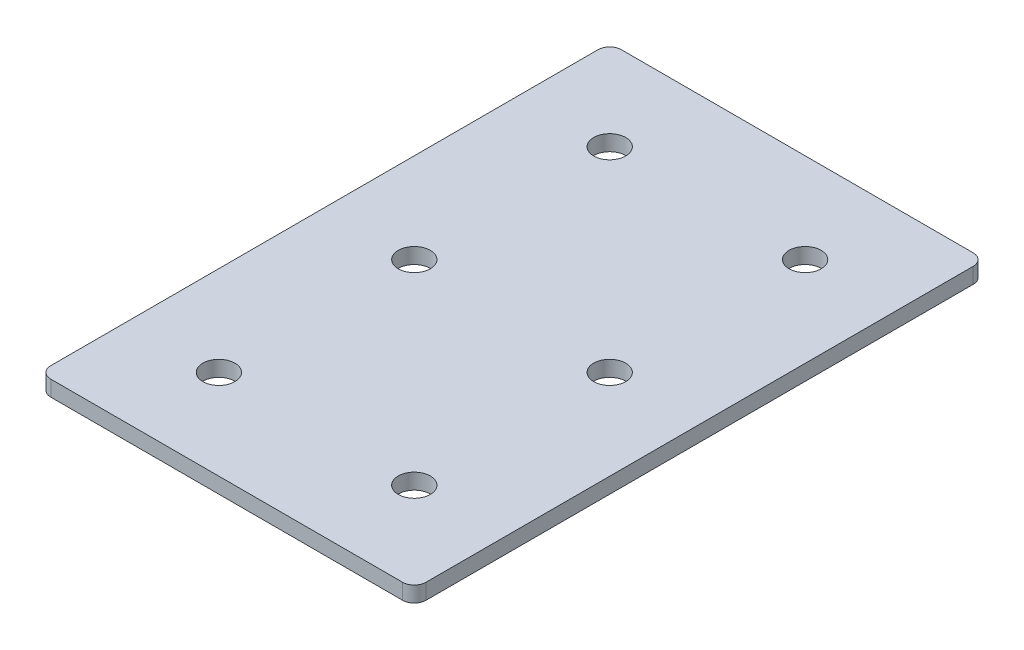
ISO-10303-21;
HEADER;
FILE_DESCRIPTION(('STEP AP214'),'2;1');
FILE_NAME('part.step','',(''),(''),'','','');
FILE_SCHEMA(('AUTOMOTIVE_DESIGN { 1 0 10303 214 1 1 1 1 }'));
ENDSEC;
DATA;
#1=APPLICATION_CONTEXT('core data for automotive mechanical design processes');
#2=APPLICATION_PROTOCOL_DEFINITION('international standard','automotive_design',2000,#1);
#3=PRODUCT_CONTEXT('',#1,'mechanical');
#4=PRODUCT('Part','Part','',(#3));
#5=PRODUCT_RELATED_PRODUCT_CATEGORY('part','',(#4));
#6=PRODUCT_DEFINITION_FORMATION('','',#4);
#7=PRODUCT_DEFINITION_CONTEXT('part definition',#1,'design');
#8=PRODUCT_DEFINITION('design','',#6,#7);
#9=PRODUCT_DEFINITION_SHAPE('','',#8);
#10=(LENGTH_UNIT() NAMED_UNIT(*) SI_UNIT(.MILLI.,.METRE.));
#11=(NAMED_UNIT(*) PLANE_ANGLE_UNIT() SI_UNIT($,.RADIAN.));
#12=(NAMED_UNIT(*) SI_UNIT($,.STERADIAN.) SOLID_ANGLE_UNIT());
#13=UNCERTAINTY_MEASURE_WITH_UNIT(LENGTH_MEASURE(1.E-05),#10,'distance_accuracy_value','');
#14=(GEOMETRIC_REPRESENTATION_CONTEXT(3) GLOBAL_UNCERTAINTY_ASSIGNED_CONTEXT((#13)) GLOBAL_UNIT_ASSIGNED_CONTEXT((#10,
#11,#12)) REPRESENTATION_CONTEXT('',''));
#15=CARTESIAN_POINT('',(0.,0.,0.));
#16=DIRECTION('',(0.,0.,1.));
#17=DIRECTION('',(1.,0.,0.));
#18=AXIS2_PLACEMENT_3D('',#15,#16,#17);
#19=CARTESIAN_POINT('',(-0.970001430630418,0.491348310229569,-51.520941998649));
#20=DIRECTION('',(0.,-1.,0.));
#21=DIRECTION('',(0.,0.,-1.));
#22=AXIS2_PLACEMENT_3D('',#19,#20,#21);
#23=PLANE('',#22);
#24=CARTESIAN_POINT('',(24.0299985693696,0.491348310229569,48.479058001351));
#25=DIRECTION('',(0.,1.,0.));
#26=DIRECTION('',(0.,0.,1.));
#27=AXIS2_PLACEMENT_3D('',#24,#25,#26);
#28=CIRCLE('',#27,4.10000000000001);
#29=CARTESIAN_POINT('',(24.0299985693696,0.491348310229569,52.579058001351));
#30=VERTEX_POINT('',#29);
#31=EDGE_CURVE('E177',#30,#30,#28,.T.);
#32=ORIENTED_EDGE('',*,*,#31,.T.);
#33=EDGE_LOOP('',(#32));
#34=FACE_BOUND('',#33,.T.);
#35=CARTESIAN_POINT('',(-25.9700014306304,0.491348310229569,48.479058001351));
#36=DIRECTION('',(0.,1.,0.));
#37=DIRECTION('',(0.,0.,1.));
#38=AXIS2_PLACEMENT_3D('',#35,#36,#37);
#39=CIRCLE('',#38,4.10000000000001);
#40=CARTESIAN_POINT('',(-25.9700014306304,0.491348310229569,52.579058001351));
#41=VERTEX_POINT('',#40);
#42=EDGE_CURVE('E171',#41,#41,#39,.T.);
#43=ORIENTED_EDGE('',*,*,#42,.T.);
#44=EDGE_LOOP('',(#43));
#45=FACE_BOUND('',#44,.T.);
#46=CARTESIAN_POINT('',(24.0299985693696,0.491348310229569,-1.520941998649));
#47=DIRECTION('',(0.,1.,0.));
#48=DIRECTION('',(0.,0.,1.));
#49=AXIS2_PLACEMENT_3D('',#46,#47,#48);
#50=CIRCLE('',#49,4.1);
#51=CARTESIAN_POINT('',(24.0299985693696,0.491348310229569,2.579058001351));
#52=VERTEX_POINT('',#51);
#53=EDGE_CURVE('E165',#52,#52,#50,.T.);
#54=ORIENTED_EDGE('',*,*,#53,.T.);
#55=EDGE_LOOP('',(#54));
#56=FACE_BOUND('',#55,.T.);
#57=CARTESIAN_POINT('',(-25.9700014306305,0.491348310229569,-1.520941998649));
#58=DIRECTION('',(0.,1.,0.));
#59=DIRECTION('',(0.,0.,1.));
#60=AXIS2_PLACEMENT_3D('',#57,#58,#59);
#61=CIRCLE('',#60,4.1);
#62=CARTESIAN_POINT('',(-25.9700014306305,0.491348310229569,2.579058001351));
#63=VERTEX_POINT('',#62);
#64=EDGE_CURVE('E159',#63,#63,#61,.T.);
#65=ORIENTED_EDGE('',*,*,#64,.T.);
#66=EDGE_LOOP('',(#65));
#67=FACE_BOUND('',#66,.T.);
#68=CARTESIAN_POINT('',(24.0299985693696,0.491348310229569,-51.520941998649));
#69=DIRECTION('',(0.,1.,0.));
#70=DIRECTION('',(0.,0.,1.));
#71=AXIS2_PLACEMENT_3D('',#68,#69,#70);
#72=CIRCLE('',#71,4.1);
#73=CARTESIAN_POINT('',(24.0299985693696,0.491348310229569,-47.420941998649));
#74=VERTEX_POINT('',#73);
#75=EDGE_CURVE('E154',#74,#74,#72,.T.);
#76=ORIENTED_EDGE('',*,*,#75,.T.);
#77=EDGE_LOOP('',(#76));
#78=FACE_BOUND('',#77,.T.);
#79=CARTESIAN_POINT('',(-25.9700014306305,0.491348310229569,-51.520941998649));
#80=DIRECTION('',(0.,1.,0.));
#81=DIRECTION('',(0.,0.,1.));
#82=AXIS2_PLACEMENT_3D('',#79,#80,#81);
#83=CIRCLE('',#82,4.1);
#84=CARTESIAN_POINT('',(-25.9700014306305,0.491348310229569,-47.420941998649));
#85=VERTEX_POINT('',#84);
#86=EDGE_CURVE('E147',#85,#85,#83,.T.);
#87=ORIENTED_EDGE('',*,*,#86,.T.);
#88=EDGE_LOOP('',(#87));
#89=FACE_BOUND('',#88,.T.);
#90=DIRECTION('',(0.,0.,-1.));
#91=VECTOR('',#90,1.);
#92=CARTESIAN_POINT('',(47.0299985693697,0.491348310229569,71.4790580013509));
#93=LINE('',#92,#91);
#94=CARTESIAN_POINT('',(47.0299985693697,0.491348310229569,68.4790580013509));
#95=VERTEX_POINT('',#94);
#96=CARTESIAN_POINT('',(47.0299985693697,0.491348310229569,-71.5209419986491));
#97=VERTEX_POINT('',#96);
#98=EDGE_CURVE('E106',#95,#97,#93,.T.);
#99=ORIENTED_EDGE('',*,*,#98,.F.);
#100=CARTESIAN_POINT('',(44.0299985693697,0.491348310229569,68.4790580013509));
#101=DIRECTION('',(0.,-1.,0.));
#102=DIRECTION('',(0.,0.,-1.));
#103=AXIS2_PLACEMENT_3D('',#100,#101,#102);
#104=CIRCLE('',#103,3.);
#105=CARTESIAN_POINT('',(44.0299985693697,0.491348310229569,71.4790580013509));
#106=VERTEX_POINT('',#105);
#107=EDGE_CURVE('E128',#95,#106,#104,.T.);
#108=ORIENTED_EDGE('',*,*,#107,.T.);
#109=DIRECTION('',(1.,0.,0.));
#110=VECTOR('',#109,1.);
#111=CARTESIAN_POINT('',(-48.9700014306305,0.491348310229569,71.4790580013509));
#112=LINE('',#111,#110);
#113=CARTESIAN_POINT('',(-45.9700014306305,0.491348310229569,71.4790580013509));
#114=VERTEX_POINT('',#113);
#115=EDGE_CURVE('E110',#114,#106,#112,.T.);
#116=ORIENTED_EDGE('',*,*,#115,.F.);
#117=CARTESIAN_POINT('',(-45.9700014306305,0.491348310229569,68.4790580013509));
#118=DIRECTION('',(0.,-1.,0.));
#119=DIRECTION('',(0.,0.,-1.));
#120=AXIS2_PLACEMENT_3D('',#117,#118,#119);
#121=CIRCLE('',#120,3.);
#122=CARTESIAN_POINT('',(-48.9700014306305,0.491348310229569,68.4790580013509));
#123=VERTEX_POINT('',#122);
#124=EDGE_CURVE('E105',#114,#123,#121,.T.);
#125=ORIENTED_EDGE('',*,*,#124,.T.);
#126=DIRECTION('',(0.,0.,1.));
#127=VECTOR('',#126,1.);
#128=CARTESIAN_POINT('',(-48.9700014306305,0.491348310229569,-74.5209419986491));
#129=LINE('',#128,#127);
#130=CARTESIAN_POINT('',(-48.9700014306305,0.491348310229569,-71.5209419986491));
#131=VERTEX_POINT('',#130);
#132=EDGE_CURVE('E137',#131,#123,#129,.T.);
#133=ORIENTED_EDGE('',*,*,#132,.F.);
#134=CARTESIAN_POINT('',(-45.9700014306305,0.491348310229569,-71.5209419986491));
#135=DIRECTION('',(0.,-1.,0.));
#136=DIRECTION('',(0.,0.,-1.));
#137=AXIS2_PLACEMENT_3D('',#134,#135,#136);
#138=CIRCLE('',#137,3.);
#139=CARTESIAN_POINT('',(-45.9700014306305,0.491348310229569,-74.5209419986491));
#140=VERTEX_POINT('',#139);
#141=EDGE_CURVE('E31',#131,#140,#138,.T.);
#142=ORIENTED_EDGE('',*,*,#141,.T.);
#143=DIRECTION('',(-1.,0.,0.));
#144=VECTOR('',#143,1.);
#145=CARTESIAN_POINT('',(47.0299985693697,0.491348310229569,-74.5209419986491));
#146=LINE('',#145,#144);
#147=CARTESIAN_POINT('',(44.0299985693697,0.491348310229569,-74.5209419986491));
#148=VERTEX_POINT('',#147);
#149=EDGE_CURVE('E138',#148,#140,#146,.T.);
#150=ORIENTED_EDGE('',*,*,#149,.F.);
#151=CARTESIAN_POINT('',(44.0299985693697,0.491348310229569,-71.5209419986491));
#152=DIRECTION('',(0.,-1.,0.));
#153=DIRECTION('',(0.,0.,-1.));
#154=AXIS2_PLACEMENT_3D('',#151,#152,#153);
#155=CIRCLE('',#154,3.);
#156=EDGE_CURVE('E126',#148,#97,#155,.T.);
#157=ORIENTED_EDGE('',*,*,#156,.T.);
#158=EDGE_LOOP('',(#99,#108,#116,#125,#133,#142,#150,#157));
#159=FACE_BOUND('',#158,.T.);
#160=ADVANCED_FACE('F16',(#34,#45,#56,#67,#78,#89,#159),#23,.T.);
#161=CARTESIAN_POINT('',(47.0299985693697,0.491348310229569,-74.5209419986491));
#162=DIRECTION('',(0.,0.,-1.));
#163=DIRECTION('',(-1.,0.,0.));
#164=AXIS2_PLACEMENT_3D('',#161,#162,#163);
#165=PLANE('',#164);
#166=DIRECTION('',(-1.,0.,0.));
#167=VECTOR('',#166,1.);
#168=CARTESIAN_POINT('',(47.0299985693697,4.49134831022957,-74.5209419986491));
#169=LINE('',#168,#167);
#170=CARTESIAN_POINT('',(44.0299985693697,4.49134831022957,-74.5209419986491));
#171=VERTEX_POINT('',#170);
#172=CARTESIAN_POINT('',(-45.9700014306305,4.49134831022957,-74.5209419986491));
#173=VERTEX_POINT('',#172);
#174=EDGE_CURVE('E144',#171,#173,#169,.T.);
#175=ORIENTED_EDGE('',*,*,#174,.F.);
#176=DIRECTION('',(0.,1.,0.));
#177=VECTOR('',#176,1.);
#178=CARTESIAN_POINT('',(44.0299985693697,0.491348310229569,-74.5209419986491));
#179=LINE('',#178,#177);
#180=EDGE_CURVE('E38',#171,#148,#179,.F.);
#181=ORIENTED_EDGE('',*,*,#180,.T.);
#182=ORIENTED_EDGE('',*,*,#149,.T.);
#183=DIRECTION('',(0.,1.,0.));
#184=VECTOR('',#183,1.);
#185=CARTESIAN_POINT('',(-45.9700014306305,0.491348310229569,-74.5209419986491));
#186=LINE('',#185,#184);
#187=EDGE_CURVE('E130',#140,#173,#186,.T.);
#188=ORIENTED_EDGE('',*,*,#187,.T.);
#189=EDGE_LOOP('',(#175,#181,#182,#188));
#190=FACE_BOUND('',#189,.T.);
#191=ADVANCED_FACE('F223',(#190),#165,.T.);
#192=CARTESIAN_POINT('',(47.0299985693697,0.491348310229569,71.4790580013509));
#193=DIRECTION('',(1.,0.,0.));
#194=DIRECTION('',(0.,0.,-1.));
#195=AXIS2_PLACEMENT_3D('',#192,#193,#194);
#196=PLANE('',#195);
#197=DIRECTION('',(0.,0.,-1.));
#198=VECTOR('',#197,1.);
#199=CARTESIAN_POINT('',(47.0299985693697,4.49134831022957,71.4790580013509));
#200=LINE('',#199,#198);
#201=CARTESIAN_POINT('',(47.0299985693697,4.49134831022957,68.4790580013509));
#202=VERTEX_POINT('',#201);
#203=CARTESIAN_POINT('',(47.0299985693697,4.49134831022957,-71.5209419986491));
#204=VERTEX_POINT('',#203);
#205=EDGE_CURVE('E102',#202,#204,#200,.T.);
#206=ORIENTED_EDGE('',*,*,#205,.F.);
#207=DIRECTION('',(0.,1.,0.));
#208=VECTOR('',#207,1.);
#209=CARTESIAN_POINT('',(47.0299985693697,0.491348310229569,68.4790580013509));
#210=LINE('',#209,#208);
#211=EDGE_CURVE('E122',#202,#95,#210,.F.);
#212=ORIENTED_EDGE('',*,*,#211,.T.);
#213=ORIENTED_EDGE('',*,*,#98,.T.);
#214=DIRECTION('',(0.,1.,0.));
#215=VECTOR('',#214,1.);
#216=CARTESIAN_POINT('',(47.0299985693697,0.491348310229569,-71.5209419986491));
#217=LINE('',#216,#215);
#218=EDGE_CURVE('E119',#97,#204,#217,.T.);
#219=ORIENTED_EDGE('',*,*,#218,.T.);
#220=EDGE_LOOP('',(#206,#212,#213,#219));
#221=FACE_BOUND('',#220,.T.);
#222=ADVANCED_FACE('F228',(#221),#196,.T.);
#223=CARTESIAN_POINT('',(-48.9700014306305,0.491348310229569,71.4790580013509));
#224=DIRECTION('',(0.,0.,1.));
#225=DIRECTION('',(1.,0.,0.));
#226=AXIS2_PLACEMENT_3D('',#223,#224,#225);
#227=PLANE('',#226);
#228=ORIENTED_EDGE('',*,*,#115,.T.);
#229=DIRECTION('',(0.,1.,0.));
#230=VECTOR('',#229,1.);
#231=CARTESIAN_POINT('',(44.0299985693697,0.491348310229569,71.4790580013509));
#232=LINE('',#231,#230);
#233=CARTESIAN_POINT('',(44.0299985693697,4.49134831022957,71.4790580013509));
#234=VERTEX_POINT('',#233);
#235=EDGE_CURVE('E93',#106,#234,#232,.T.);
#236=ORIENTED_EDGE('',*,*,#235,.T.);
#237=DIRECTION('',(1.,0.,0.));
#238=VECTOR('',#237,1.);
#239=CARTESIAN_POINT('',(-48.9700014306305,4.49134831022957,71.4790580013509));
#240=LINE('',#239,#238);
#241=CARTESIAN_POINT('',(-45.9700014306305,4.49134831022957,71.4790580013509));
#242=VERTEX_POINT('',#241);
#243=EDGE_CURVE('E85',#242,#234,#240,.T.);
#244=ORIENTED_EDGE('',*,*,#243,.F.);
#245=DIRECTION('',(0.,1.,0.));
#246=VECTOR('',#245,1.);
#247=CARTESIAN_POINT('',(-45.9700014306305,0.491348310229569,71.4790580013509));
#248=LINE('',#247,#246);
#249=EDGE_CURVE('E99',#242,#114,#248,.F.);
#250=ORIENTED_EDGE('',*,*,#249,.T.);
#251=EDGE_LOOP('',(#228,#236,#244,#250));
#252=FACE_BOUND('',#251,.T.);
#253=ADVANCED_FACE('F98',(#252),#227,.T.);
#254=CARTESIAN_POINT('',(-48.9700014306305,0.491348310229569,-74.5209419986491));
#255=DIRECTION('',(-1.,0.,0.));
#256=DIRECTION('',(0.,0.,1.));
#257=AXIS2_PLACEMENT_3D('',#254,#255,#256);
#258=PLANE('',#257);
#259=DIRECTION('',(0.,0.,1.));
#260=VECTOR('',#259,1.);
#261=CARTESIAN_POINT('',(-48.9700014306305,4.49134831022957,-74.5209419986491));
#262=LINE('',#261,#260);
#263=CARTESIAN_POINT('',(-48.9700014306305,4.49134831022957,-71.5209419986491));
#264=VERTEX_POINT('',#263);
#265=CARTESIAN_POINT('',(-48.9700014306305,4.49134831022957,68.4790580013509));
#266=VERTEX_POINT('',#265);
#267=EDGE_CURVE('E87',#264,#266,#262,.T.);
#268=ORIENTED_EDGE('',*,*,#267,.F.);
#269=DIRECTION('',(0.,1.,0.));
#270=VECTOR('',#269,1.);
#271=CARTESIAN_POINT('',(-48.9700014306305,0.491348310229569,-71.5209419986491));
#272=LINE('',#271,#270);
#273=EDGE_CURVE('E10',#264,#131,#272,.F.);
#274=ORIENTED_EDGE('',*,*,#273,.T.);
#275=ORIENTED_EDGE('',*,*,#132,.T.);
#276=DIRECTION('',(0.,1.,0.));
#277=VECTOR('',#276,1.);
#278=CARTESIAN_POINT('',(-48.9700014306305,0.491348310229569,68.4790580013509));
#279=LINE('',#278,#277);
#280=EDGE_CURVE('E24',#123,#266,#279,.T.);
#281=ORIENTED_EDGE('',*,*,#280,.T.);
#282=EDGE_LOOP('',(#268,#274,#275,#281));
#283=FACE_BOUND('',#282,.T.);
#284=ADVANCED_FACE('F135',(#283),#258,.T.);
#285=CARTESIAN_POINT('',(-0.970001430630418,4.49134831022957,-51.520941998649));
#286=DIRECTION('',(0.,-1.,0.));
#287=DIRECTION('',(0.,0.,-1.));
#288=AXIS2_PLACEMENT_3D('',#285,#286,#287);
#289=PLANE('',#288);
#290=CARTESIAN_POINT('',(24.0299985693696,4.49134831022957,48.479058001351));
#291=DIRECTION('',(0.,1.,0.));
#292=DIRECTION('',(0.,0.,1.));
#293=AXIS2_PLACEMENT_3D('',#290,#291,#292);
#294=CIRCLE('',#293,4.10000000000001);
#295=CARTESIAN_POINT('',(24.0299985693696,4.49134831022957,52.579058001351));
#296=VERTEX_POINT('',#295);
#297=EDGE_CURVE('E180',#296,#296,#294,.T.);
#298=ORIENTED_EDGE('',*,*,#297,.F.);
#299=EDGE_LOOP('',(#298));
#300=FACE_BOUND('',#299,.T.);
#301=CARTESIAN_POINT('',(-25.9700014306304,4.49134831022957,48.479058001351));
#302=DIRECTION('',(0.,1.,0.));
#303=DIRECTION('',(0.,0.,1.));
#304=AXIS2_PLACEMENT_3D('',#301,#302,#303);
#305=CIRCLE('',#304,4.10000000000001);
#306=CARTESIAN_POINT('',(-25.9700014306304,4.49134831022957,52.579058001351));
#307=VERTEX_POINT('',#306);
#308=EDGE_CURVE('E174',#307,#307,#305,.T.);
#309=ORIENTED_EDGE('',*,*,#308,.F.);
#310=EDGE_LOOP('',(#309));
#311=FACE_BOUND('',#310,.T.);
#312=CARTESIAN_POINT('',(24.0299985693696,4.49134831022957,-1.520941998649));
#313=DIRECTION('',(0.,1.,0.));
#314=DIRECTION('',(0.,0.,1.));
#315=AXIS2_PLACEMENT_3D('',#312,#313,#314);
#316=CIRCLE('',#315,4.1);
#317=CARTESIAN_POINT('',(24.0299985693696,4.49134831022957,2.579058001351));
#318=VERTEX_POINT('',#317);
#319=EDGE_CURVE('E168',#318,#318,#316,.T.);
#320=ORIENTED_EDGE('',*,*,#319,.F.);
#321=EDGE_LOOP('',(#320));
#322=FACE_BOUND('',#321,.T.);
#323=CARTESIAN_POINT('',(-25.9700014306305,4.49134831022957,-1.520941998649));
#324=DIRECTION('',(0.,1.,0.));
#325=DIRECTION('',(0.,0.,1.));
#326=AXIS2_PLACEMENT_3D('',#323,#324,#325);
#327=CIRCLE('',#326,4.1);
#328=CARTESIAN_POINT('',(-25.9700014306305,4.49134831022957,2.579058001351));
#329=VERTEX_POINT('',#328);
#330=EDGE_CURVE('E162',#329,#329,#327,.T.);
#331=ORIENTED_EDGE('',*,*,#330,.F.);
#332=EDGE_LOOP('',(#331));
#333=FACE_BOUND('',#332,.T.);
#334=CARTESIAN_POINT('',(24.0299985693696,4.49134831022957,-51.520941998649));
#335=DIRECTION('',(0.,1.,0.));
#336=DIRECTION('',(0.,0.,1.));
#337=AXIS2_PLACEMENT_3D('',#334,#335,#336);
#338=CIRCLE('',#337,4.1);
#339=CARTESIAN_POINT('',(24.0299985693696,4.49134831022957,-47.420941998649));
#340=VERTEX_POINT('',#339);
#341=EDGE_CURVE('E156',#340,#340,#338,.T.);
#342=ORIENTED_EDGE('',*,*,#341,.F.);
#343=EDGE_LOOP('',(#342));
#344=FACE_BOUND('',#343,.T.);
#345=CARTESIAN_POINT('',(-25.9700014306305,4.49134831022957,-51.520941998649));
#346=DIRECTION('',(0.,1.,0.));
#347=DIRECTION('',(0.,0.,1.));
#348=AXIS2_PLACEMENT_3D('',#345,#346,#347);
#349=CIRCLE('',#348,4.1);
#350=CARTESIAN_POINT('',(-25.9700014306305,4.49134831022957,-47.420941998649));
#351=VERTEX_POINT('',#350);
#352=EDGE_CURVE('E149',#351,#351,#349,.T.);
#353=ORIENTED_EDGE('',*,*,#352,.F.);
#354=EDGE_LOOP('',(#353));
#355=FACE_BOUND('',#354,.T.);
#356=ORIENTED_EDGE('',*,*,#243,.T.);
#357=CARTESIAN_POINT('',(44.0299985693697,4.49134831022957,68.4790580013509));
#358=DIRECTION('',(0.,-1.,0.));
#359=DIRECTION('',(0.,0.,-1.));
#360=AXIS2_PLACEMENT_3D('',#357,#358,#359);
#361=CIRCLE('',#360,3.);
#362=EDGE_CURVE('E117',#234,#202,#361,.F.);
#363=ORIENTED_EDGE('',*,*,#362,.T.);
#364=ORIENTED_EDGE('',*,*,#205,.T.);
#365=CARTESIAN_POINT('',(44.0299985693697,4.49134831022957,-71.5209419986491));
#366=DIRECTION('',(0.,-1.,0.));
#367=DIRECTION('',(0.,0.,-1.));
#368=AXIS2_PLACEMENT_3D('',#365,#366,#367);
#369=CIRCLE('',#368,3.);
#370=EDGE_CURVE('E115',#204,#171,#369,.F.);
#371=ORIENTED_EDGE('',*,*,#370,.T.);
#372=ORIENTED_EDGE('',*,*,#174,.T.);
#373=CARTESIAN_POINT('',(-45.9700014306305,4.49134831022957,-71.5209419986491));
#374=DIRECTION('',(0.,-1.,0.));
#375=DIRECTION('',(0.,0.,-1.));
#376=AXIS2_PLACEMENT_3D('',#373,#374,#375);
#377=CIRCLE('',#376,3.);
#378=EDGE_CURVE('E92',#173,#264,#377,.F.);
#379=ORIENTED_EDGE('',*,*,#378,.T.);
#380=ORIENTED_EDGE('',*,*,#267,.T.);
#381=CARTESIAN_POINT('',(-45.9700014306305,4.49134831022957,68.4790580013509));
#382=DIRECTION('',(0.,-1.,0.));
#383=DIRECTION('',(0.,0.,-1.));
#384=AXIS2_PLACEMENT_3D('',#381,#382,#383);
#385=CIRCLE('',#384,3.);
#386=EDGE_CURVE('E82',#266,#242,#385,.F.);
#387=ORIENTED_EDGE('',*,*,#386,.T.);
#388=EDGE_LOOP('',(#356,#363,#364,#371,#372,#379,#380,#387));
#389=FACE_BOUND('',#388,.T.);
#390=ADVANCED_FACE('F84',(#300,#311,#322,#333,#344,#355,#389),#289,.F.);
#391=CARTESIAN_POINT('',(-25.9700014306305,0.491348310229569,-51.520941998649));
#392=DIRECTION('',(0.,1.,0.));
#393=DIRECTION('',(0.,0.,1.));
#394=AXIS2_PLACEMENT_3D('',#391,#392,#393);
#395=CYLINDRICAL_SURFACE('',#394,4.1);
#396=ORIENTED_EDGE('',*,*,#86,.F.);
#397=EDGE_LOOP('',(#396));
#398=FACE_BOUND('',#397,.T.);
#399=ORIENTED_EDGE('',*,*,#352,.T.);
#400=EDGE_LOOP('',(#399));
#401=FACE_BOUND('',#400,.T.);
#402=ADVANCED_FACE('F198',(#398,#401),#395,.F.);
#403=CARTESIAN_POINT('',(24.0299985693696,0.491348310229569,-51.520941998649));
#404=DIRECTION('',(0.,1.,0.));
#405=DIRECTION('',(0.,0.,1.));
#406=AXIS2_PLACEMENT_3D('',#403,#404,#405);
#407=CYLINDRICAL_SURFACE('',#406,4.1);
#408=ORIENTED_EDGE('',*,*,#75,.F.);
#409=EDGE_LOOP('',(#408));
#410=FACE_BOUND('',#409,.T.);
#411=ORIENTED_EDGE('',*,*,#341,.T.);
#412=EDGE_LOOP('',(#411));
#413=FACE_BOUND('',#412,.T.);
#414=ADVANCED_FACE('F211',(#410,#413),#407,.F.);
#415=CARTESIAN_POINT('',(-25.9700014306305,0.491348310229569,-1.520941998649));
#416=DIRECTION('',(0.,1.,0.));
#417=DIRECTION('',(0.,0.,1.));
#418=AXIS2_PLACEMENT_3D('',#415,#416,#417);
#419=CYLINDRICAL_SURFACE('',#418,4.1);
#420=ORIENTED_EDGE('',*,*,#64,.F.);
#421=EDGE_LOOP('',(#420));
#422=FACE_BOUND('',#421,.T.);
#423=ORIENTED_EDGE('',*,*,#330,.T.);
#424=EDGE_LOOP('',(#423));
#425=FACE_BOUND('',#424,.T.);
#426=ADVANCED_FACE('F218',(#422,#425),#419,.F.);
#427=CARTESIAN_POINT('',(24.0299985693696,0.491348310229569,-1.520941998649));
#428=DIRECTION('',(0.,1.,0.));
#429=DIRECTION('',(0.,0.,1.));
#430=AXIS2_PLACEMENT_3D('',#427,#428,#429);
#431=CYLINDRICAL_SURFACE('',#430,4.1);
#432=ORIENTED_EDGE('',*,*,#53,.F.);
#433=EDGE_LOOP('',(#432));
#434=FACE_BOUND('',#433,.T.);
#435=ORIENTED_EDGE('',*,*,#319,.T.);
#436=EDGE_LOOP('',(#435));
#437=FACE_BOUND('',#436,.T.);
#438=ADVANCED_FACE('F291',(#434,#437),#431,.F.);
#439=CARTESIAN_POINT('',(-25.9700014306304,0.491348310229569,48.479058001351));
#440=DIRECTION('',(0.,1.,0.));
#441=DIRECTION('',(0.,0.,1.));
#442=AXIS2_PLACEMENT_3D('',#439,#440,#441);
#443=CYLINDRICAL_SURFACE('',#442,4.10000000000001);
#444=ORIENTED_EDGE('',*,*,#42,.F.);
#445=EDGE_LOOP('',(#444));
#446=FACE_BOUND('',#445,.T.);
#447=ORIENTED_EDGE('',*,*,#308,.T.);
#448=EDGE_LOOP('',(#447));
#449=FACE_BOUND('',#448,.T.);
#450=ADVANCED_FACE('F192',(#446,#449),#443,.F.);
#451=CARTESIAN_POINT('',(24.0299985693696,0.491348310229569,48.479058001351));
#452=DIRECTION('',(0.,1.,0.));
#453=DIRECTION('',(0.,0.,1.));
#454=AXIS2_PLACEMENT_3D('',#451,#452,#453);
#455=CYLINDRICAL_SURFACE('',#454,4.10000000000001);
#456=ORIENTED_EDGE('',*,*,#31,.F.);
#457=EDGE_LOOP('',(#456));
#458=FACE_BOUND('',#457,.T.);
#459=ORIENTED_EDGE('',*,*,#297,.T.);
#460=EDGE_LOOP('',(#459));
#461=FACE_BOUND('',#460,.T.);
#462=ADVANCED_FACE('F188',(#458,#461),#455,.F.);
#463=CARTESIAN_POINT('',(44.0299985693697,0.491348310229569,68.4790580013509));
#464=DIRECTION('',(0.,1.,0.));
#465=DIRECTION('',(0.,0.,1.));
#466=AXIS2_PLACEMENT_3D('',#463,#464,#465);
#467=CYLINDRICAL_SURFACE('',#466,3.);
#468=ORIENTED_EDGE('',*,*,#107,.F.);
#469=ORIENTED_EDGE('',*,*,#211,.F.);
#470=ORIENTED_EDGE('',*,*,#362,.F.);
#471=ORIENTED_EDGE('',*,*,#235,.F.);
#472=EDGE_LOOP('',(#468,#469,#470,#471));
#473=FACE_BOUND('',#472,.T.);
#474=ADVANCED_FACE('F191',(#473),#467,.T.);
#475=CARTESIAN_POINT('',(44.0299985693697,0.491348310229569,-71.5209419986491));
#476=DIRECTION('',(0.,1.,0.));
#477=DIRECTION('',(0.,0.,1.));
#478=AXIS2_PLACEMENT_3D('',#475,#476,#477);
#479=CYLINDRICAL_SURFACE('',#478,3.);
#480=ORIENTED_EDGE('',*,*,#156,.F.);
#481=ORIENTED_EDGE('',*,*,#180,.F.);
#482=ORIENTED_EDGE('',*,*,#370,.F.);
#483=ORIENTED_EDGE('',*,*,#218,.F.);
#484=EDGE_LOOP('',(#480,#481,#482,#483));
#485=FACE_BOUND('',#484,.T.);
#486=ADVANCED_FACE('F233',(#485),#479,.T.);
#487=CARTESIAN_POINT('',(-45.9700014306305,0.491348310229569,-71.5209419986491));
#488=DIRECTION('',(0.,1.,0.));
#489=DIRECTION('',(0.,0.,1.));
#490=AXIS2_PLACEMENT_3D('',#487,#488,#489);
#491=CYLINDRICAL_SURFACE('',#490,3.);
#492=ORIENTED_EDGE('',*,*,#141,.F.);
#493=ORIENTED_EDGE('',*,*,#273,.F.);
#494=ORIENTED_EDGE('',*,*,#378,.F.);
#495=ORIENTED_EDGE('',*,*,#187,.F.);
#496=EDGE_LOOP('',(#492,#493,#494,#495));
#497=FACE_BOUND('',#496,.T.);
#498=ADVANCED_FACE('F236',(#497),#491,.T.);
#499=CARTESIAN_POINT('',(-45.9700014306305,0.491348310229569,68.4790580013509));
#500=DIRECTION('',(0.,1.,0.));
#501=DIRECTION('',(0.,0.,1.));
#502=AXIS2_PLACEMENT_3D('',#499,#500,#501);
#503=CYLINDRICAL_SURFACE('',#502,3.);
#504=ORIENTED_EDGE('',*,*,#124,.F.);
#505=ORIENTED_EDGE('',*,*,#249,.F.);
#506=ORIENTED_EDGE('',*,*,#386,.F.);
#507=ORIENTED_EDGE('',*,*,#280,.F.);
#508=EDGE_LOOP('',(#504,#505,#506,#507));
#509=FACE_BOUND('',#508,.T.);
#510=ADVANCED_FACE('F18',(#509),#503,.T.);
#511=CLOSED_SHELL('',(#160,#191,#222,#253,#284,#390,#402,#414,#426,#438,#450,#462,#474,#486,
#498,#510));
#512=MANIFOLD_SOLID_BREP('B1',#511);
#513=ADVANCED_BREP_SHAPE_REPRESENTATION('',(#18,#512),#14);
#514=SHAPE_DEFINITION_REPRESENTATION(#9,#513);
ENDSEC;
END-ISO-10303-21;
